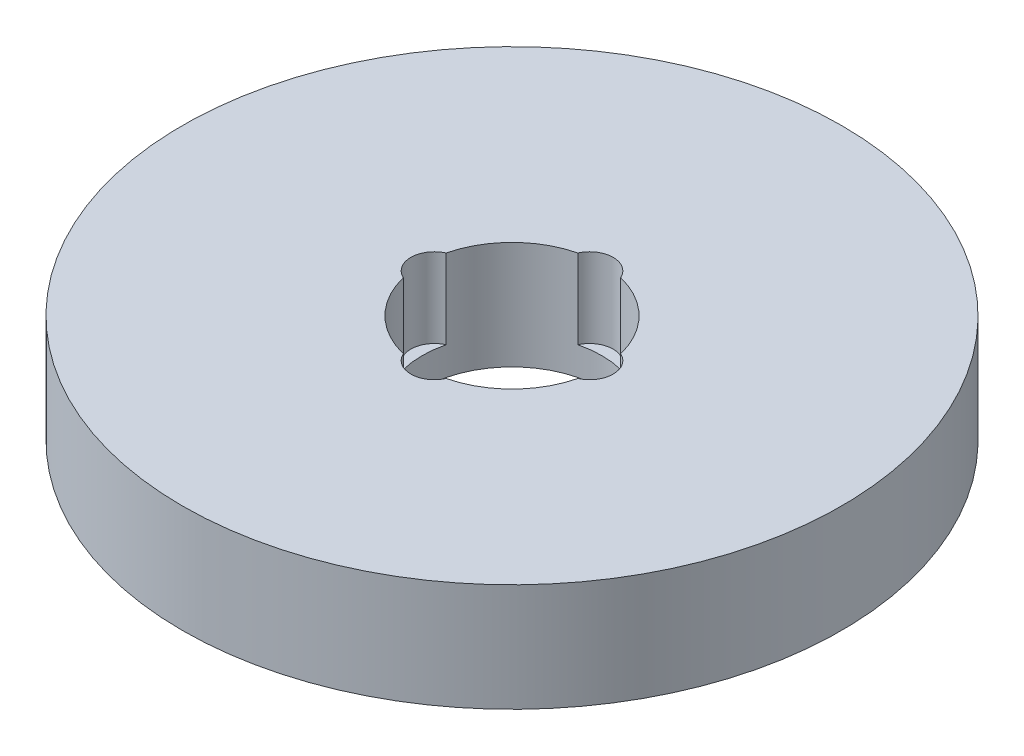
ISO-10303-21;
HEADER;
FILE_DESCRIPTION(('STEP AP214'),'2;1');
FILE_NAME('part.step','',(''),(''),'','','');
FILE_SCHEMA(('AUTOMOTIVE_DESIGN { 1 0 10303 214 1 1 1 1 }'));
ENDSEC;
DATA;
#1=APPLICATION_CONTEXT('core data for automotive mechanical design processes');
#2=APPLICATION_PROTOCOL_DEFINITION('international standard','automotive_design',2000,#1);
#3=PRODUCT_CONTEXT('',#1,'mechanical');
#4=PRODUCT('Part','Part','',(#3));
#5=PRODUCT_RELATED_PRODUCT_CATEGORY('part','',(#4));
#6=PRODUCT_DEFINITION_FORMATION('','',#4);
#7=PRODUCT_DEFINITION_CONTEXT('part definition',#1,'design');
#8=PRODUCT_DEFINITION('design','',#6,#7);
#9=PRODUCT_DEFINITION_SHAPE('','',#8);
#10=(LENGTH_UNIT() NAMED_UNIT(*) SI_UNIT(.MILLI.,.METRE.));
#11=(NAMED_UNIT(*) PLANE_ANGLE_UNIT() SI_UNIT($,.RADIAN.));
#12=(NAMED_UNIT(*) SI_UNIT($,.STERADIAN.) SOLID_ANGLE_UNIT());
#13=UNCERTAINTY_MEASURE_WITH_UNIT(LENGTH_MEASURE(1.E-05),#10,'distance_accuracy_value','');
#14=(GEOMETRIC_REPRESENTATION_CONTEXT(3) GLOBAL_UNCERTAINTY_ASSIGNED_CONTEXT((#13)) GLOBAL_UNIT_ASSIGNED_CONTEXT((#10,
#11,#12)) REPRESENTATION_CONTEXT('',''));
#15=CARTESIAN_POINT('',(0.,0.,0.));
#16=DIRECTION('',(0.,0.,1.));
#17=DIRECTION('',(1.,0.,0.));
#18=AXIS2_PLACEMENT_3D('',#15,#16,#17);
#19=CARTESIAN_POINT('',(0.,27.,0.));
#20=DIRECTION('',(0.,-1.,0.));
#21=DIRECTION('',(0.,0.,-1.));
#22=AXIS2_PLACEMENT_3D('',#19,#20,#21);
#23=CYLINDRICAL_SURFACE('',#22,82.5);
#24=CARTESIAN_POINT('',(0.,27.,0.));
#25=DIRECTION('',(0.,1.,0.));
#26=DIRECTION('',(0.,0.,1.));
#27=AXIS2_PLACEMENT_3D('',#24,#25,#26);
#28=CIRCLE('',#27,82.5);
#29=CARTESIAN_POINT('',(0.,27.,82.5));
#30=VERTEX_POINT('',#29);
#31=EDGE_CURVE('E148',#30,#30,#28,.T.);
#32=ORIENTED_EDGE('',*,*,#31,.F.);
#33=EDGE_LOOP('',(#32));
#34=FACE_BOUND('',#33,.T.);
#35=CARTESIAN_POINT('',(0.,0.,0.));
#36=DIRECTION('',(0.,1.,0.));
#37=DIRECTION('',(0.,0.,1.));
#38=AXIS2_PLACEMENT_3D('',#35,#36,#37);
#39=CIRCLE('',#38,82.5);
#40=CARTESIAN_POINT('',(0.,0.,82.5));
#41=VERTEX_POINT('',#40);
#42=EDGE_CURVE('E139',#41,#41,#39,.T.);
#43=ORIENTED_EDGE('',*,*,#42,.T.);
#44=EDGE_LOOP('',(#43));
#45=FACE_BOUND('',#44,.T.);
#46=ADVANCED_FACE('F39',(#34,#45),#23,.T.);
#47=CARTESIAN_POINT('',(0.,27.,0.));
#48=DIRECTION('',(0.,1.,0.));
#49=DIRECTION('',(0.,0.,1.));
#50=AXIS2_PLACEMENT_3D('',#47,#48,#49);
#51=PLANE('',#50);
#52=CARTESIAN_POINT('',(0.,27.,19.4511521674577));
#53=DIRECTION('',(0.,1.,0.));
#54=DIRECTION('',(1.,0.,0.));
#55=AXIS2_PLACEMENT_3D('',#52,#53,#54);
#56=CIRCLE('',#55,5.86749347568535);
#57=CARTESIAN_POINT('',(-5.35293751942866,27.,21.8539712618346));
#58=VERTEX_POINT('',#57);
#59=CARTESIAN_POINT('',(5.35293751942881,27.,21.8539712618346));
#60=VERTEX_POINT('',#59);
#61=EDGE_CURVE('E175',#58,#60,#56,.T.);
#62=ORIENTED_EDGE('',*,*,#61,.F.);
#63=CARTESIAN_POINT('',(0.,27.,0.));
#64=DIRECTION('',(0.,1.,0.));
#65=DIRECTION('',(0.,0.,1.));
#66=AXIS2_PLACEMENT_3D('',#63,#64,#65);
#67=CIRCLE('',#66,22.5);
#68=CARTESIAN_POINT('',(-21.8539712618346,27.,5.35293751942874));
#69=VERTEX_POINT('',#68);
#70=EDGE_CURVE('E134',#69,#58,#67,.T.);
#71=ORIENTED_EDGE('',*,*,#70,.F.);
#72=CARTESIAN_POINT('',(-19.4511521674577,27.,0.));
#73=DIRECTION('',(0.,1.,0.));
#74=DIRECTION('',(0.,0.,1.));
#75=AXIS2_PLACEMENT_3D('',#72,#73,#74);
#76=CIRCLE('',#75,5.86749347568535);
#77=CARTESIAN_POINT('',(-21.8539712618346,27.,-5.35293751942874));
#78=VERTEX_POINT('',#77);
#79=EDGE_CURVE('E143',#78,#69,#76,.T.);
#80=ORIENTED_EDGE('',*,*,#79,.F.);
#81=CARTESIAN_POINT('',(-5.35293751942897,27.,-21.8539712618345));
#82=VERTEX_POINT('',#81);
#83=EDGE_CURVE('E123',#82,#78,#67,.T.);
#84=ORIENTED_EDGE('',*,*,#83,.F.);
#85=CARTESIAN_POINT('',(-2.0374000443503E-13,27.,-19.4511521674577));
#86=DIRECTION('',(0.,1.,0.));
#87=DIRECTION('',(-1.,0.,0.));
#88=AXIS2_PLACEMENT_3D('',#85,#86,#87);
#89=CIRCLE('',#88,5.86749347568535);
#90=CARTESIAN_POINT('',(5.35293751942851,27.,-21.8539712618346));
#91=VERTEX_POINT('',#90);
#92=EDGE_CURVE('E106',#91,#82,#89,.T.);
#93=ORIENTED_EDGE('',*,*,#92,.F.);
#94=CARTESIAN_POINT('',(21.8539712618346,27.,-5.35293751942874));
#95=VERTEX_POINT('',#94);
#96=EDGE_CURVE('E125',#95,#91,#67,.T.);
#97=ORIENTED_EDGE('',*,*,#96,.F.);
#98=CARTESIAN_POINT('',(19.4511521674577,27.,0.));
#99=DIRECTION('',(0.,1.,0.));
#100=DIRECTION('',(0.,0.,-1.));
#101=AXIS2_PLACEMENT_3D('',#98,#99,#100);
#102=CIRCLE('',#101,5.86749347568535);
#103=CARTESIAN_POINT('',(21.8539712618346,27.,5.35293751942874));
#104=VERTEX_POINT('',#103);
#105=EDGE_CURVE('E286',#104,#95,#102,.T.);
#106=ORIENTED_EDGE('',*,*,#105,.F.);
#107=EDGE_CURVE('E135',#60,#104,#67,.T.);
#108=ORIENTED_EDGE('',*,*,#107,.F.);
#109=EDGE_LOOP('',(#62,#71,#80,#84,#93,#97,#106,#108));
#110=FACE_BOUND('',#109,.T.);
#111=ORIENTED_EDGE('',*,*,#31,.T.);
#112=EDGE_LOOP('',(#111));
#113=FACE_BOUND('',#112,.T.);
#114=ADVANCED_FACE('F118',(#110,#113),#51,.T.);
#115=CARTESIAN_POINT('',(0.,0.,0.));
#116=DIRECTION('',(0.,1.,0.));
#117=DIRECTION('',(0.,0.,1.));
#118=AXIS2_PLACEMENT_3D('',#115,#116,#117);
#119=PLANE('',#118);
#120=CARTESIAN_POINT('',(0.,0.,0.));
#121=DIRECTION('',(0.,1.,0.));
#122=DIRECTION('',(0.,0.,1.));
#123=AXIS2_PLACEMENT_3D('',#120,#121,#122);
#124=CIRCLE('',#123,22.5);
#125=CARTESIAN_POINT('',(0.,0.,22.5));
#126=VERTEX_POINT('',#125);
#127=EDGE_CURVE('E136',#126,#126,#124,.T.);
#128=ORIENTED_EDGE('',*,*,#127,.T.);
#129=EDGE_LOOP('',(#128));
#130=FACE_BOUND('',#129,.T.);
#131=ORIENTED_EDGE('',*,*,#42,.F.);
#132=EDGE_LOOP('',(#131));
#133=FACE_BOUND('',#132,.T.);
#134=ADVANCED_FACE('F187',(#130,#133),#119,.F.);
#135=CARTESIAN_POINT('',(0.,27.,0.));
#136=DIRECTION('',(0.,-1.,0.));
#137=DIRECTION('',(0.,0.,-1.));
#138=AXIS2_PLACEMENT_3D('',#135,#136,#137);
#139=CYLINDRICAL_SURFACE('',#138,22.5);
#140=DIRECTION('',(0.,1.,0.));
#141=VECTOR('',#140,1.);
#142=CARTESIAN_POINT('',(-5.35293751942866,17.0516366288655,21.8539712618346));
#143=LINE('',#142,#141);
#144=CARTESIAN_POINT('',(-5.35293751942866,7.10327325773093,21.8539712618346));
#145=VERTEX_POINT('',#144);
#146=EDGE_CURVE('E11',#145,#58,#143,.T.);
#147=ORIENTED_EDGE('',*,*,#146,.F.);
#148=CARTESIAN_POINT('',(0.,7.10327325773093,0.));
#149=DIRECTION('',(0.,1.,0.));
#150=DIRECTION('',(0.,0.,1.));
#151=AXIS2_PLACEMENT_3D('',#148,#149,#150);
#152=CIRCLE('',#151,22.5);
#153=CARTESIAN_POINT('',(5.35293751942881,7.10327325773093,21.8539712618346));
#154=VERTEX_POINT('',#153);
#155=EDGE_CURVE('E170',#145,#154,#152,.T.);
#156=ORIENTED_EDGE('',*,*,#155,.T.);
#157=DIRECTION('',(0.,1.,0.));
#158=VECTOR('',#157,1.);
#159=CARTESIAN_POINT('',(5.35293751942881,17.0516366288655,21.8539712618346));
#160=LINE('',#159,#158);
#161=EDGE_CURVE('E46',#60,#154,#160,.F.);
#162=ORIENTED_EDGE('',*,*,#161,.F.);
#163=ORIENTED_EDGE('',*,*,#107,.T.);
#164=DIRECTION('',(0.,1.,0.));
#165=VECTOR('',#164,1.);
#166=CARTESIAN_POINT('',(21.8539712618346,17.0516366288655,5.35293751942874));
#167=LINE('',#166,#165);
#168=CARTESIAN_POINT('',(21.8539712618346,7.10327325773093,5.35293751942874));
#169=VERTEX_POINT('',#168);
#170=EDGE_CURVE('E164',#169,#104,#167,.T.);
#171=ORIENTED_EDGE('',*,*,#170,.F.);
#172=CARTESIAN_POINT('',(0.,7.10327325773093,0.));
#173=DIRECTION('',(0.,1.,0.));
#174=DIRECTION('',(0.,0.,1.));
#175=AXIS2_PLACEMENT_3D('',#172,#173,#174);
#176=CIRCLE('',#175,22.5);
#177=CARTESIAN_POINT('',(21.8539712618346,7.10327325773093,-5.35293751942874));
#178=VERTEX_POINT('',#177);
#179=EDGE_CURVE('E115',#169,#178,#176,.T.);
#180=ORIENTED_EDGE('',*,*,#179,.T.);
#181=DIRECTION('',(0.,1.,0.));
#182=VECTOR('',#181,1.);
#183=CARTESIAN_POINT('',(21.8539712618346,17.0516366288655,-5.35293751942874));
#184=LINE('',#183,#182);
#185=EDGE_CURVE('E131',#95,#178,#184,.F.);
#186=ORIENTED_EDGE('',*,*,#185,.F.);
#187=ORIENTED_EDGE('',*,*,#96,.T.);
#188=DIRECTION('',(0.,1.,0.));
#189=VECTOR('',#188,1.);
#190=CARTESIAN_POINT('',(5.35293751942851,17.0516366288655,-21.8539712618346));
#191=LINE('',#190,#189);
#192=CARTESIAN_POINT('',(5.35293751942851,7.10327325773093,-21.8539712618346));
#193=VERTEX_POINT('',#192);
#194=EDGE_CURVE('E105',#193,#91,#191,.T.);
#195=ORIENTED_EDGE('',*,*,#194,.F.);
#196=CARTESIAN_POINT('',(0.,7.10327325773093,0.));
#197=DIRECTION('',(0.,1.,0.));
#198=DIRECTION('',(0.,0.,1.));
#199=AXIS2_PLACEMENT_3D('',#196,#197,#198);
#200=CIRCLE('',#199,22.5);
#201=CARTESIAN_POINT('',(-5.35293751942897,7.10327325773093,-21.8539712618345));
#202=VERTEX_POINT('',#201);
#203=EDGE_CURVE('E159',#193,#202,#200,.T.);
#204=ORIENTED_EDGE('',*,*,#203,.T.);
#205=DIRECTION('',(0.,1.,0.));
#206=VECTOR('',#205,1.);
#207=CARTESIAN_POINT('',(-5.35293751942897,17.0516366288655,-21.8539712618345));
#208=LINE('',#207,#206);
#209=EDGE_CURVE('E114',#82,#202,#208,.F.);
#210=ORIENTED_EDGE('',*,*,#209,.F.);
#211=ORIENTED_EDGE('',*,*,#83,.T.);
#212=DIRECTION('',(0.,1.,0.));
#213=VECTOR('',#212,1.);
#214=CARTESIAN_POINT('',(-21.8539712618346,17.0516366288655,-5.35293751942874));
#215=LINE('',#214,#213);
#216=CARTESIAN_POINT('',(-21.8539712618346,7.10327325773093,-5.35293751942874));
#217=VERTEX_POINT('',#216);
#218=EDGE_CURVE('E160',#217,#78,#215,.T.);
#219=ORIENTED_EDGE('',*,*,#218,.F.);
#220=CARTESIAN_POINT('',(0.,7.10327325773093,0.));
#221=DIRECTION('',(0.,1.,0.));
#222=DIRECTION('',(0.,0.,1.));
#223=AXIS2_PLACEMENT_3D('',#220,#221,#222);
#224=CIRCLE('',#223,22.5);
#225=CARTESIAN_POINT('',(-21.8539712618346,7.10327325773093,5.35293751942874));
#226=VERTEX_POINT('',#225);
#227=EDGE_CURVE('E149',#217,#226,#224,.T.);
#228=ORIENTED_EDGE('',*,*,#227,.T.);
#229=DIRECTION('',(0.,1.,0.));
#230=VECTOR('',#229,1.);
#231=CARTESIAN_POINT('',(-21.8539712618346,17.0516366288655,5.35293751942874));
#232=LINE('',#231,#230);
#233=EDGE_CURVE('E152',#69,#226,#232,.F.);
#234=ORIENTED_EDGE('',*,*,#233,.F.);
#235=ORIENTED_EDGE('',*,*,#70,.T.);
#236=EDGE_LOOP('',(#147,#156,#162,#163,#171,#180,#186,#187,#195,#204,#210,#211,#219,#228,#234,#235));
#237=FACE_BOUND('',#236,.T.);
#238=ORIENTED_EDGE('',*,*,#127,.F.);
#239=EDGE_LOOP('',(#238));
#240=FACE_BOUND('',#239,.T.);
#241=ADVANCED_FACE('F126',(#237,#240),#139,.F.);
#242=CARTESIAN_POINT('',(-19.4511521674577,7.10327325773093,0.));
#243=DIRECTION('',(0.,1.,0.));
#244=DIRECTION('',(0.,0.,1.));
#245=AXIS2_PLACEMENT_3D('',#242,#243,#244);
#246=CYLINDRICAL_SURFACE('',#245,5.86749347568535);
#247=ORIENTED_EDGE('',*,*,#218,.T.);
#248=ORIENTED_EDGE('',*,*,#79,.T.);
#249=ORIENTED_EDGE('',*,*,#233,.T.);
#250=CARTESIAN_POINT('',(-19.4511521674577,7.10327325773093,0.));
#251=DIRECTION('',(0.,1.,0.));
#252=DIRECTION('',(0.,0.,1.));
#253=AXIS2_PLACEMENT_3D('',#250,#251,#252);
#254=CIRCLE('',#253,5.86749347568535);
#255=EDGE_CURVE('E144',#217,#226,#254,.T.);
#256=ORIENTED_EDGE('',*,*,#255,.F.);
#257=EDGE_LOOP('',(#247,#248,#249,#256));
#258=FACE_BOUND('',#257,.T.);
#259=ADVANCED_FACE('F200',(#258),#246,.F.);
#260=CARTESIAN_POINT('',(-19.4511521674577,7.10327325773093,0.));
#261=DIRECTION('',(0.,1.,0.));
#262=DIRECTION('',(0.,0.,1.));
#263=AXIS2_PLACEMENT_3D('',#260,#261,#262);
#264=PLANE('',#263);
#265=ORIENTED_EDGE('',*,*,#255,.T.);
#266=ORIENTED_EDGE('',*,*,#227,.F.);
#267=EDGE_LOOP('',(#265,#266));
#268=FACE_BOUND('',#267,.T.);
#269=ADVANCED_FACE('F201',(#268),#264,.T.);
#270=CARTESIAN_POINT('',(-2.0374000443503E-13,7.10327325773093,-19.4511521674577));
#271=DIRECTION('',(0.,1.,0.));
#272=DIRECTION('',(0.,0.,1.));
#273=AXIS2_PLACEMENT_3D('',#270,#271,#272);
#274=CYLINDRICAL_SURFACE('',#273,5.86749347568535);
#275=ORIENTED_EDGE('',*,*,#194,.T.);
#276=ORIENTED_EDGE('',*,*,#92,.T.);
#277=ORIENTED_EDGE('',*,*,#209,.T.);
#278=CARTESIAN_POINT('',(-2.0374000443503E-13,7.10327325773093,-19.4511521674577));
#279=DIRECTION('',(0.,1.,0.));
#280=DIRECTION('',(-1.,0.,0.));
#281=AXIS2_PLACEMENT_3D('',#278,#279,#280);
#282=CIRCLE('',#281,5.86749347568535);
#283=EDGE_CURVE('E107',#193,#202,#282,.T.);
#284=ORIENTED_EDGE('',*,*,#283,.F.);
#285=EDGE_LOOP('',(#275,#276,#277,#284));
#286=FACE_BOUND('',#285,.T.);
#287=ADVANCED_FACE('F102',(#286),#274,.F.);
#288=CARTESIAN_POINT('',(-2.0374000443503E-13,7.10327325773093,-19.4511521674577));
#289=DIRECTION('',(0.,1.,0.));
#290=DIRECTION('',(-1.,0.,0.));
#291=AXIS2_PLACEMENT_3D('',#288,#289,#290);
#292=PLANE('',#291);
#293=ORIENTED_EDGE('',*,*,#283,.T.);
#294=ORIENTED_EDGE('',*,*,#203,.F.);
#295=EDGE_LOOP('',(#293,#294));
#296=FACE_BOUND('',#295,.T.);
#297=ADVANCED_FACE('F209',(#296),#292,.T.);
#298=CARTESIAN_POINT('',(19.4511521674577,7.10327325773093,0.));
#299=DIRECTION('',(0.,1.,0.));
#300=DIRECTION('',(0.,0.,1.));
#301=AXIS2_PLACEMENT_3D('',#298,#299,#300);
#302=CYLINDRICAL_SURFACE('',#301,5.86749347568535);
#303=ORIENTED_EDGE('',*,*,#170,.T.);
#304=ORIENTED_EDGE('',*,*,#105,.T.);
#305=ORIENTED_EDGE('',*,*,#185,.T.);
#306=CARTESIAN_POINT('',(19.4511521674577,7.10327325773093,0.));
#307=DIRECTION('',(0.,1.,0.));
#308=DIRECTION('',(0.,0.,-1.));
#309=AXIS2_PLACEMENT_3D('',#306,#307,#308);
#310=CIRCLE('',#309,5.86749347568535);
#311=EDGE_CURVE('E56',#169,#178,#310,.T.);
#312=ORIENTED_EDGE('',*,*,#311,.F.);
#313=EDGE_LOOP('',(#303,#304,#305,#312));
#314=FACE_BOUND('',#313,.T.);
#315=ADVANCED_FACE('F213',(#314),#302,.F.);
#316=CARTESIAN_POINT('',(19.4511521674577,7.10327325773093,0.));
#317=DIRECTION('',(0.,1.,0.));
#318=DIRECTION('',(0.,0.,-1.));
#319=AXIS2_PLACEMENT_3D('',#316,#317,#318);
#320=PLANE('',#319);
#321=ORIENTED_EDGE('',*,*,#311,.T.);
#322=ORIENTED_EDGE('',*,*,#179,.F.);
#323=EDGE_LOOP('',(#321,#322));
#324=FACE_BOUND('',#323,.T.);
#325=ADVANCED_FACE('F179',(#324),#320,.T.);
#326=CARTESIAN_POINT('',(0.,7.10327325773093,19.4511521674577));
#327=DIRECTION('',(0.,1.,0.));
#328=DIRECTION('',(0.,0.,1.));
#329=AXIS2_PLACEMENT_3D('',#326,#327,#328);
#330=CYLINDRICAL_SURFACE('',#329,5.86749347568535);
#331=ORIENTED_EDGE('',*,*,#146,.T.);
#332=ORIENTED_EDGE('',*,*,#61,.T.);
#333=ORIENTED_EDGE('',*,*,#161,.T.);
#334=CARTESIAN_POINT('',(0.,7.10327325773093,19.4511521674577));
#335=DIRECTION('',(0.,1.,0.));
#336=DIRECTION('',(1.,0.,0.));
#337=AXIS2_PLACEMENT_3D('',#334,#335,#336);
#338=CIRCLE('',#337,5.86749347568535);
#339=EDGE_CURVE('E55',#145,#154,#338,.T.);
#340=ORIENTED_EDGE('',*,*,#339,.F.);
#341=EDGE_LOOP('',(#331,#332,#333,#340));
#342=FACE_BOUND('',#341,.T.);
#343=ADVANCED_FACE('F171',(#342),#330,.F.);
#344=CARTESIAN_POINT('',(0.,7.10327325773093,19.4511521674577));
#345=DIRECTION('',(0.,1.,0.));
#346=DIRECTION('',(1.,0.,0.));
#347=AXIS2_PLACEMENT_3D('',#344,#345,#346);
#348=PLANE('',#347);
#349=ORIENTED_EDGE('',*,*,#339,.T.);
#350=ORIENTED_EDGE('',*,*,#155,.F.);
#351=EDGE_LOOP('',(#349,#350));
#352=FACE_BOUND('',#351,.T.);
#353=ADVANCED_FACE('F173',(#352),#348,.T.);
#354=CLOSED_SHELL('',(#46,#114,#134,#241,#259,#269,#287,#297,#315,#325,#343,#353));
#355=MANIFOLD_SOLID_BREP('B2',#354);
#356=ADVANCED_BREP_SHAPE_REPRESENTATION('',(#18,#355),#14);
#357=SHAPE_DEFINITION_REPRESENTATION(#9,#356);
ENDSEC;
END-ISO-10303-21;
